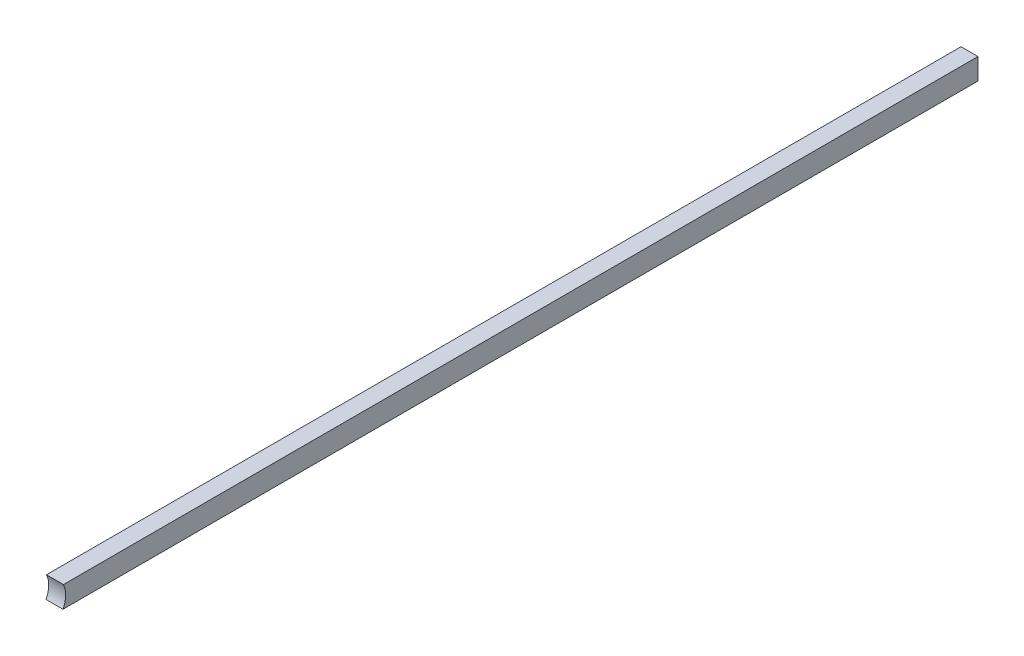
ISO-10303-21;
HEADER;
FILE_DESCRIPTION(('STEP AP214'),'2;1');
FILE_NAME('part.step','',(''),(''),'','','');
FILE_SCHEMA(('AUTOMOTIVE_DESIGN { 1 0 10303 214 1 1 1 1 }'));
ENDSEC;
DATA;
#1=APPLICATION_CONTEXT('core data for automotive mechanical design processes');
#2=APPLICATION_PROTOCOL_DEFINITION('international standard','automotive_design',2000,#1);
#3=PRODUCT_CONTEXT('',#1,'mechanical');
#4=PRODUCT('Part','Part','',(#3));
#5=PRODUCT_RELATED_PRODUCT_CATEGORY('part','',(#4));
#6=PRODUCT_DEFINITION_FORMATION('','',#4);
#7=PRODUCT_DEFINITION_CONTEXT('part definition',#1,'design');
#8=PRODUCT_DEFINITION('design','',#6,#7);
#9=PRODUCT_DEFINITION_SHAPE('','',#8);
#10=(LENGTH_UNIT() NAMED_UNIT(*) SI_UNIT(.MILLI.,.METRE.));
#11=(NAMED_UNIT(*) PLANE_ANGLE_UNIT() SI_UNIT($,.RADIAN.));
#12=(NAMED_UNIT(*) SI_UNIT($,.STERADIAN.) SOLID_ANGLE_UNIT());
#13=UNCERTAINTY_MEASURE_WITH_UNIT(LENGTH_MEASURE(1.E-05),#10,'distance_accuracy_value','');
#14=(GEOMETRIC_REPRESENTATION_CONTEXT(3) GLOBAL_UNCERTAINTY_ASSIGNED_CONTEXT((#13)) GLOBAL_UNIT_ASSIGNED_CONTEXT((#10,
#11,#12)) REPRESENTATION_CONTEXT('',''));
#15=CARTESIAN_POINT('',(0.,0.,0.));
#16=DIRECTION('',(0.,0.,1.));
#17=DIRECTION('',(1.,0.,0.));
#18=AXIS2_PLACEMENT_3D('',#15,#16,#17);
#19=CARTESIAN_POINT('',(-5324.50196322812,4797.07977327688,4437.475));
#20=DIRECTION('',(1.,0.,0.));
#21=DIRECTION('',(0.,0.,-1.));
#22=AXIS2_PLACEMENT_3D('',#19,#20,#21);
#23=PLANE('',#22);
#24=CARTESIAN_POINT('',(-5324.50196322812,4750.,4328.));
#25=DIRECTION('',(1.,0.,0.));
#26=DIRECTION('',(0.,0.,-1.));
#27=AXIS2_PLACEMENT_3D('',#24,#25,#26);
#28=CIRCLE('',#27,109.474);
#29=CARTESIAN_POINT('',(-5324.50196322812,4797.07977327688,4229.16654602718));
#30=VERTEX_POINT('',#29);
#31=CARTESIAN_POINT('',(-5324.50196322812,4699.02801867908,4231.11649368329));
#32=VERTEX_POINT('',#31);
#33=EDGE_CURVE('E35',#30,#32,#28,.F.);
#34=ORIENTED_EDGE('',*,*,#33,.F.);
#35=DIRECTION('',(0.,0.,-1.));
#36=VECTOR('',#35,1.);
#37=CARTESIAN_POINT('',(-5324.50196322812,4797.07977327688,4437.475));
#38=LINE('',#37,#36);
#39=CARTESIAN_POINT('',(-5324.50196322812,4797.07977327688,0.));
#40=VERTEX_POINT('',#39);
#41=EDGE_CURVE('E91',#30,#40,#38,.T.);
#42=ORIENTED_EDGE('',*,*,#41,.T.);
#43=DIRECTION('',(0.,-1.,0.));
#44=VECTOR('',#43,1.);
#45=CARTESIAN_POINT('',(-5324.50196322812,4797.07977327688,0.));
#46=LINE('',#45,#44);
#47=CARTESIAN_POINT('',(-5324.50196322812,4699.02801867908,0.));
#48=VERTEX_POINT('',#47);
#49=EDGE_CURVE('E82',#40,#48,#46,.T.);
#50=ORIENTED_EDGE('',*,*,#49,.T.);
#51=DIRECTION('',(0.,0.,-1.));
#52=VECTOR('',#51,1.);
#53=CARTESIAN_POINT('',(-5324.50196322812,4699.02801867908,4437.475));
#54=LINE('',#53,#52);
#55=EDGE_CURVE('E73',#32,#48,#54,.T.);
#56=ORIENTED_EDGE('',*,*,#55,.F.);
#57=EDGE_LOOP('',(#34,#42,#50,#56));
#58=FACE_BOUND('',#57,.T.);
#59=ADVANCED_FACE('F31',(#58),#23,.F.);
#60=CARTESIAN_POINT('',(-5324.50196322812,4699.02801867908,4437.475));
#61=DIRECTION('',(0.,1.,0.));
#62=DIRECTION('',(0.,0.,1.));
#63=AXIS2_PLACEMENT_3D('',#60,#61,#62);
#64=PLANE('',#63);
#65=DIRECTION('',(1.,0.,0.));
#66=VECTOR('',#65,1.);
#67=CARTESIAN_POINT('',(-5443.604,4699.02801867908,4231.11649368329));
#68=LINE('',#67,#66);
#69=CARTESIAN_POINT('',(-5246.06055954988,4699.02801867908,4231.11649368329));
#70=VERTEX_POINT('',#69);
#71=EDGE_CURVE('E79',#32,#70,#68,.T.);
#72=ORIENTED_EDGE('',*,*,#71,.F.);
#73=ORIENTED_EDGE('',*,*,#55,.T.);
#74=DIRECTION('',(1.,0.,0.));
#75=VECTOR('',#74,1.);
#76=CARTESIAN_POINT('',(-5324.50196322812,4699.02801867908,0.));
#77=LINE('',#76,#75);
#78=CARTESIAN_POINT('',(-5246.06055954988,4699.02801867908,0.));
#79=VERTEX_POINT('',#78);
#80=EDGE_CURVE('E76',#48,#79,#77,.T.);
#81=ORIENTED_EDGE('',*,*,#80,.T.);
#82=DIRECTION('',(0.,0.,-1.));
#83=VECTOR('',#82,1.);
#84=CARTESIAN_POINT('',(-5246.06055954988,4699.02801867908,4437.475));
#85=LINE('',#84,#83);
#86=EDGE_CURVE('E67',#70,#79,#85,.T.);
#87=ORIENTED_EDGE('',*,*,#86,.F.);
#88=EDGE_LOOP('',(#72,#73,#81,#87));
#89=FACE_BOUND('',#88,.T.);
#90=ADVANCED_FACE('F75',(#89),#64,.F.);
#91=CARTESIAN_POINT('',(-5246.06055954988,4797.07977327688,4437.475));
#92=DIRECTION('',(-1.,0.,0.));
#93=DIRECTION('',(0.,0.,1.));
#94=AXIS2_PLACEMENT_3D('',#91,#92,#93);
#95=PLANE('',#94);
#96=CARTESIAN_POINT('',(-5246.06055954988,4750.,4328.));
#97=DIRECTION('',(-1.,0.,0.));
#98=DIRECTION('',(0.,0.,1.));
#99=AXIS2_PLACEMENT_3D('',#96,#97,#98);
#100=CIRCLE('',#99,109.474);
#101=CARTESIAN_POINT('',(-5246.06055954988,4797.07977327688,4229.16654602718));
#102=VERTEX_POINT('',#101);
#103=EDGE_CURVE('E41',#70,#102,#100,.F.);
#104=ORIENTED_EDGE('',*,*,#103,.F.);
#105=ORIENTED_EDGE('',*,*,#86,.T.);
#106=DIRECTION('',(0.,1.,0.));
#107=VECTOR('',#106,1.);
#108=CARTESIAN_POINT('',(-5246.06055954988,4797.07977327688,0.));
#109=LINE('',#108,#107);
#110=CARTESIAN_POINT('',(-5246.06055954988,4797.07977327688,0.));
#111=VERTEX_POINT('',#110);
#112=EDGE_CURVE('E88',#79,#111,#109,.T.);
#113=ORIENTED_EDGE('',*,*,#112,.T.);
#114=DIRECTION('',(0.,0.,-1.));
#115=VECTOR('',#114,1.);
#116=CARTESIAN_POINT('',(-5246.06055954988,4797.07977327688,4437.475));
#117=LINE('',#116,#115);
#118=EDGE_CURVE('E98',#102,#111,#117,.T.);
#119=ORIENTED_EDGE('',*,*,#118,.F.);
#120=EDGE_LOOP('',(#104,#105,#113,#119));
#121=FACE_BOUND('',#120,.T.);
#122=ADVANCED_FACE('F104',(#121),#95,.F.);
#123=CARTESIAN_POINT('',(-5324.50196322812,4797.07977327688,4437.475));
#124=DIRECTION('',(0.,-1.,0.));
#125=DIRECTION('',(0.,0.,-1.));
#126=AXIS2_PLACEMENT_3D('',#123,#124,#125);
#127=PLANE('',#126);
#128=DIRECTION('',(1.,0.,0.));
#129=VECTOR('',#128,1.);
#130=CARTESIAN_POINT('',(-5443.604,4797.07977327688,4229.16654602718));
#131=LINE('',#130,#129);
#132=EDGE_CURVE('E11',#102,#30,#131,.F.);
#133=ORIENTED_EDGE('',*,*,#132,.F.);
#134=ORIENTED_EDGE('',*,*,#118,.T.);
#135=DIRECTION('',(-1.,0.,0.));
#136=VECTOR('',#135,1.);
#137=CARTESIAN_POINT('',(-5324.50196322812,4797.07977327688,0.));
#138=LINE('',#137,#136);
#139=EDGE_CURVE('E99',#111,#40,#138,.T.);
#140=ORIENTED_EDGE('',*,*,#139,.T.);
#141=ORIENTED_EDGE('',*,*,#41,.F.);
#142=EDGE_LOOP('',(#133,#134,#140,#141));
#143=FACE_BOUND('',#142,.T.);
#144=ADVANCED_FACE('F105',(#143),#127,.F.);
#145=CARTESIAN_POINT('',(-5324.50196322812,4699.02801867908,0.));
#146=DIRECTION('',(0.,0.,1.));
#147=DIRECTION('',(1.,0.,0.));
#148=AXIS2_PLACEMENT_3D('',#145,#146,#147);
#149=PLANE('',#148);
#150=ORIENTED_EDGE('',*,*,#49,.F.);
#151=ORIENTED_EDGE('',*,*,#139,.F.);
#152=ORIENTED_EDGE('',*,*,#112,.F.);
#153=ORIENTED_EDGE('',*,*,#80,.F.);
#154=EDGE_LOOP('',(#150,#151,#152,#153));
#155=FACE_BOUND('',#154,.T.);
#156=ADVANCED_FACE('F86',(#155),#149,.F.);
#157=CARTESIAN_POINT('',(-5443.604,4750.,4328.));
#158=DIRECTION('',(1.,0.,0.));
#159=DIRECTION('',(0.,-0.707106781186547,-0.707106781186547));
#160=AXIS2_PLACEMENT_3D('',#157,#158,#159);
#161=CYLINDRICAL_SURFACE('',#160,109.474);
#162=ORIENTED_EDGE('',*,*,#33,.T.);
#163=ORIENTED_EDGE('',*,*,#71,.T.);
#164=ORIENTED_EDGE('',*,*,#103,.T.);
#165=ORIENTED_EDGE('',*,*,#132,.T.);
#166=EDGE_LOOP('',(#162,#163,#164,#165));
#167=FACE_BOUND('',#166,.T.);
#168=ADVANCED_FACE('F33',(#167),#161,.F.);
#169=CLOSED_SHELL('',(#59,#90,#122,#144,#156,#168));
#170=MANIFOLD_SOLID_BREP('B2',#169);
#171=ADVANCED_BREP_SHAPE_REPRESENTATION('',(#18,#170),#14);
#172=SHAPE_DEFINITION_REPRESENTATION(#9,#171);
ENDSEC;
END-ISO-10303-21;
